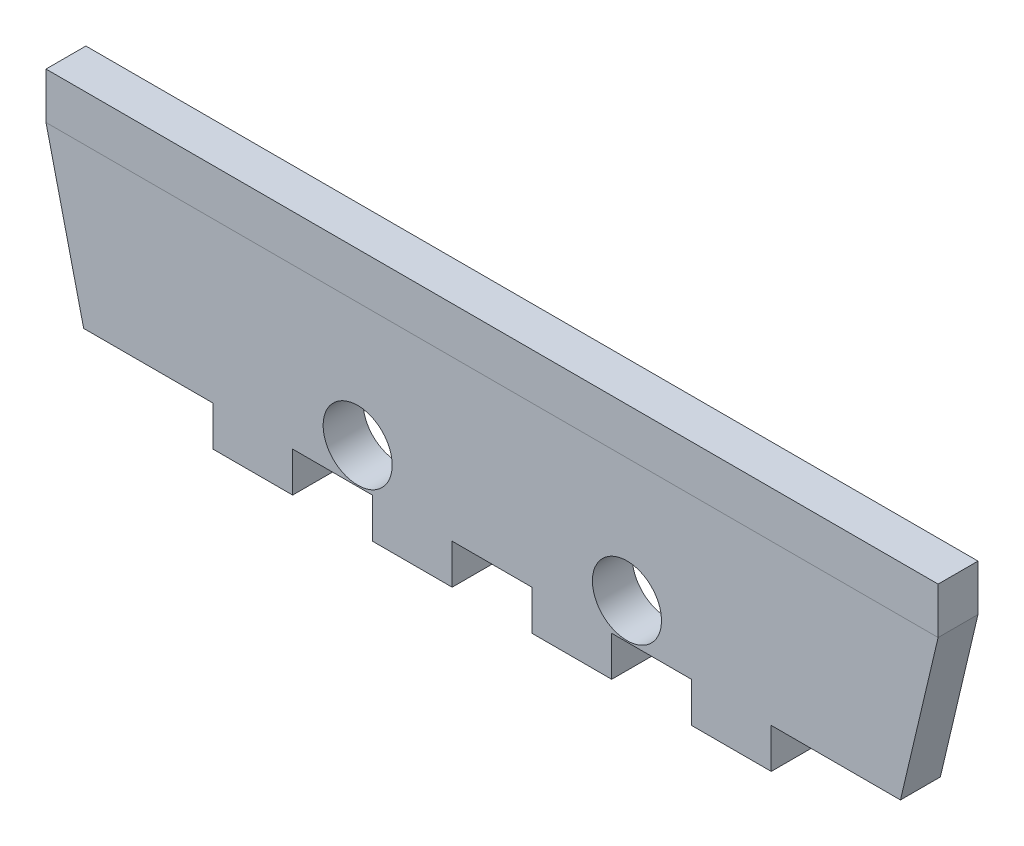
ISO-10303-21;
HEADER;
FILE_DESCRIPTION(('STEP AP214'),'2;1');
FILE_NAME('part.step','',(''),(''),'','','');
FILE_SCHEMA(('AUTOMOTIVE_DESIGN { 1 0 10303 214 1 1 1 1 }'));
ENDSEC;
DATA;
#1=APPLICATION_CONTEXT('core data for automotive mechanical design processes');
#2=APPLICATION_PROTOCOL_DEFINITION('international standard','automotive_design',2000,#1);
#3=PRODUCT_CONTEXT('',#1,'mechanical');
#4=PRODUCT('Part','Part','',(#3));
#5=PRODUCT_RELATED_PRODUCT_CATEGORY('part','',(#4));
#6=PRODUCT_DEFINITION_FORMATION('','',#4);
#7=PRODUCT_DEFINITION_CONTEXT('part definition',#1,'design');
#8=PRODUCT_DEFINITION('design','',#6,#7);
#9=PRODUCT_DEFINITION_SHAPE('','',#8);
#10=(LENGTH_UNIT() NAMED_UNIT(*) SI_UNIT(.MILLI.,.METRE.));
#11=(NAMED_UNIT(*) PLANE_ANGLE_UNIT() SI_UNIT($,.RADIAN.));
#12=(NAMED_UNIT(*) SI_UNIT($,.STERADIAN.) SOLID_ANGLE_UNIT());
#13=UNCERTAINTY_MEASURE_WITH_UNIT(LENGTH_MEASURE(1.E-05),#10,'distance_accuracy_value','');
#14=(GEOMETRIC_REPRESENTATION_CONTEXT(3) GLOBAL_UNCERTAINTY_ASSIGNED_CONTEXT((#13)) GLOBAL_UNIT_ASSIGNED_CONTEXT((#10,
#11,#12)) REPRESENTATION_CONTEXT('',''));
#15=CARTESIAN_POINT('',(0.,0.,0.));
#16=DIRECTION('',(0.,0.,1.));
#17=DIRECTION('',(1.,0.,0.));
#18=AXIS2_PLACEMENT_3D('',#15,#16,#17);
#19=CARTESIAN_POINT('',(-2.9972,0.,0.));
#20=DIRECTION('',(-1.,0.,0.));
#21=DIRECTION('',(0.,0.,1.));
#22=AXIS2_PLACEMENT_3D('',#19,#20,#21);
#23=PLANE('',#22);
#24=DIRECTION('',(0.,-1.,0.));
#25=VECTOR('',#24,1.);
#26=CARTESIAN_POINT('',(-2.9972,0.,3.175));
#27=LINE('',#26,#25);
#28=CARTESIAN_POINT('',(-2.9972,3.683,3.175));
#29=VERTEX_POINT('',#28);
#30=CARTESIAN_POINT('',(-2.9972,0.,3.175));
#31=VERTEX_POINT('',#30);
#32=EDGE_CURVE('E217',#29,#31,#27,.T.);
#33=ORIENTED_EDGE('',*,*,#32,.F.);
#34=DIRECTION('',(0.,0.,1.));
#35=VECTOR('',#34,1.);
#36=CARTESIAN_POINT('',(-2.9972,3.683,0.));
#37=LINE('',#36,#35);
#38=CARTESIAN_POINT('',(-2.9972,3.683,0.));
#39=VERTEX_POINT('',#38);
#40=EDGE_CURVE('E13',#39,#29,#37,.T.);
#41=ORIENTED_EDGE('',*,*,#40,.F.);
#42=DIRECTION('',(0.,-1.,0.));
#43=VECTOR('',#42,1.);
#44=CARTESIAN_POINT('',(-2.9972,0.,0.));
#45=LINE('',#44,#43);
#46=CARTESIAN_POINT('',(-2.9972,0.,0.));
#47=VERTEX_POINT('',#46);
#48=EDGE_CURVE('E211',#39,#47,#45,.T.);
#49=ORIENTED_EDGE('',*,*,#48,.T.);
#50=DIRECTION('',(0.,0.,1.));
#51=VECTOR('',#50,1.);
#52=CARTESIAN_POINT('',(-2.9972,0.,0.));
#53=LINE('',#52,#51);
#54=EDGE_CURVE('E156',#47,#31,#53,.T.);
#55=ORIENTED_EDGE('',*,*,#54,.T.);
#56=EDGE_LOOP('',(#33,#41,#49,#55));
#57=FACE_BOUND('',#56,.T.);
#58=ADVANCED_FACE('F153',(#57),#23,.T.);
#59=CARTESIAN_POINT('',(-2.9972,3.683,0.));
#60=DIRECTION('',(0.,1.,0.));
#61=DIRECTION('',(0.,0.,1.));
#62=AXIS2_PLACEMENT_3D('',#59,#60,#61);
#63=PLANE('',#62);
#64=DIRECTION('',(-1.,0.,0.));
#65=VECTOR('',#64,1.);
#66=CARTESIAN_POINT('',(-2.9972,3.683,3.175));
#67=LINE('',#66,#65);
#68=CARTESIAN_POINT('',(68.0212,3.683,3.175));
#69=VERTEX_POINT('',#68);
#70=EDGE_CURVE('E213',#69,#29,#67,.T.);
#71=ORIENTED_EDGE('',*,*,#70,.F.);
#72=DIRECTION('',(0.,0.,1.));
#73=VECTOR('',#72,1.);
#74=CARTESIAN_POINT('',(68.0212,3.683,0.));
#75=LINE('',#74,#73);
#76=CARTESIAN_POINT('',(68.0212,3.683,0.));
#77=VERTEX_POINT('',#76);
#78=EDGE_CURVE('E162',#77,#69,#75,.T.);
#79=ORIENTED_EDGE('',*,*,#78,.F.);
#80=DIRECTION('',(-1.,0.,0.));
#81=VECTOR('',#80,1.);
#82=CARTESIAN_POINT('',(-2.9972,3.683,0.));
#83=LINE('',#82,#81);
#84=EDGE_CURVE('E208',#77,#39,#83,.T.);
#85=ORIENTED_EDGE('',*,*,#84,.T.);
#86=ORIENTED_EDGE('',*,*,#40,.T.);
#87=EDGE_LOOP('',(#71,#79,#85,#86));
#88=FACE_BOUND('',#87,.T.);
#89=ADVANCED_FACE('F227',(#88),#63,.T.);
#90=CARTESIAN_POINT('',(68.0212,0.,0.));
#91=DIRECTION('',(1.,0.,0.));
#92=DIRECTION('',(0.,0.,-1.));
#93=AXIS2_PLACEMENT_3D('',#90,#91,#92);
#94=PLANE('',#93);
#95=DIRECTION('',(0.,1.,0.));
#96=VECTOR('',#95,1.);
#97=CARTESIAN_POINT('',(68.0212,0.,3.175));
#98=LINE('',#97,#96);
#99=CARTESIAN_POINT('',(68.0212,0.,3.175));
#100=VERTEX_POINT('',#99);
#101=EDGE_CURVE('E203',#100,#69,#98,.T.);
#102=ORIENTED_EDGE('',*,*,#101,.F.);
#103=DIRECTION('',(0.,0.,1.));
#104=VECTOR('',#103,1.);
#105=CARTESIAN_POINT('',(68.0212,0.,0.));
#106=LINE('',#105,#104);
#107=CARTESIAN_POINT('',(68.0212,0.,0.));
#108=VERTEX_POINT('',#107);
#109=EDGE_CURVE('E198',#108,#100,#106,.T.);
#110=ORIENTED_EDGE('',*,*,#109,.F.);
#111=DIRECTION('',(0.,1.,0.));
#112=VECTOR('',#111,1.);
#113=CARTESIAN_POINT('',(68.0212,0.,0.));
#114=LINE('',#113,#112);
#115=EDGE_CURVE('E201',#108,#77,#114,.T.);
#116=ORIENTED_EDGE('',*,*,#115,.T.);
#117=ORIENTED_EDGE('',*,*,#78,.T.);
#118=EDGE_LOOP('',(#102,#110,#116,#117));
#119=FACE_BOUND('',#118,.T.);
#120=ADVANCED_FACE('F200',(#119),#94,.T.);
#121=CARTESIAN_POINT('',(-2.9972,0.,0.));
#122=DIRECTION('',(0.,-1.,0.));
#123=DIRECTION('',(0.,0.,-1.));
#124=AXIS2_PLACEMENT_3D('',#121,#122,#123);
#125=PLANE('',#124);
#126=DIRECTION('',(1.,0.,0.));
#127=VECTOR('',#126,1.);
#128=CARTESIAN_POINT('',(-2.9972,0.,3.175));
#129=LINE('',#128,#127);
#130=EDGE_CURVE('E220',#31,#100,#129,.T.);
#131=ORIENTED_EDGE('',*,*,#130,.F.);
#132=ORIENTED_EDGE('',*,*,#54,.F.);
#133=DIRECTION('',(1.,0.,0.));
#134=VECTOR('',#133,1.);
#135=CARTESIAN_POINT('',(-2.9972,0.,0.));
#136=LINE('',#135,#134);
#137=EDGE_CURVE('E207',#47,#108,#136,.T.);
#138=ORIENTED_EDGE('',*,*,#137,.T.);
#139=ORIENTED_EDGE('',*,*,#109,.T.);
#140=EDGE_LOOP('',(#131,#132,#138,#139));
#141=FACE_BOUND('',#140,.T.);
#142=ADVANCED_FACE('F210',(#141),#125,.T.);
#143=CARTESIAN_POINT('',(0.,0.,0.));
#144=DIRECTION('',(0.,0.,-1.));
#145=DIRECTION('',(-1.,0.,0.));
#146=AXIS2_PLACEMENT_3D('',#143,#144,#145);
#147=PLANE('',#146);
#148=ORIENTED_EDGE('',*,*,#48,.F.);
#149=ORIENTED_EDGE('',*,*,#84,.F.);
#150=ORIENTED_EDGE('',*,*,#115,.F.);
#151=ORIENTED_EDGE('',*,*,#137,.F.);
#152=EDGE_LOOP('',(#148,#149,#150,#151));
#153=FACE_BOUND('',#152,.T.);
#154=ADVANCED_FACE('F206',(#153),#147,.T.);
#155=CARTESIAN_POINT('',(0.,0.,3.175));
#156=DIRECTION('',(0.,0.,-1.));
#157=DIRECTION('',(-1.,0.,0.));
#158=AXIS2_PLACEMENT_3D('',#155,#156,#157);
#159=PLANE('',#158);
#160=ORIENTED_EDGE('',*,*,#32,.T.);
#161=ORIENTED_EDGE('',*,*,#130,.T.);
#162=ORIENTED_EDGE('',*,*,#101,.T.);
#163=ORIENTED_EDGE('',*,*,#70,.T.);
#164=EDGE_LOOP('',(#160,#161,#162,#163));
#165=FACE_BOUND('',#164,.T.);
#166=ADVANCED_FACE('F226',(#165),#159,.F.);
#167=CLOSED_SHELL('',(#58,#89,#120,#142,#154,#166));
#168=MANIFOLD_SOLID_BREP('B2',#167);
#169=CARTESIAN_POINT('',(0.,-12.7,3.175));
#170=DIRECTION('',(0.,-1.,0.));
#171=DIRECTION('',(1.,0.,0.));
#172=AXIS2_PLACEMENT_3D('',#169,#170,#171);
#173=PLANE('',#172);
#174=DIRECTION('',(-1.,0.,0.));
#175=VECTOR('',#174,1.);
#176=CARTESIAN_POINT('',(0.,-12.7,0.));
#177=LINE('',#176,#175);
#178=CARTESIAN_POINT('',(65.024,-12.7,0.));
#179=VERTEX_POINT('',#178);
#180=CARTESIAN_POINT('',(54.737,-12.7,0.));
#181=VERTEX_POINT('',#180);
#182=EDGE_CURVE('E442',#179,#181,#177,.T.);
#183=ORIENTED_EDGE('',*,*,#182,.F.);
#184=DIRECTION('',(0.,0.,-1.));
#185=VECTOR('',#184,1.);
#186=CARTESIAN_POINT('',(65.024,-12.7,3.175));
#187=LINE('',#186,#185);
#188=CARTESIAN_POINT('',(65.024,-12.7,3.175));
#189=VERTEX_POINT('',#188);
#190=EDGE_CURVE('E151',#189,#179,#187,.T.);
#191=ORIENTED_EDGE('',*,*,#190,.F.);
#192=DIRECTION('',(-1.,0.,0.));
#193=VECTOR('',#192,1.);
#194=CARTESIAN_POINT('',(0.,-12.7,3.175));
#195=LINE('',#194,#193);
#196=CARTESIAN_POINT('',(54.737,-12.7,3.175));
#197=VERTEX_POINT('',#196);
#198=EDGE_CURVE('E489',#189,#197,#195,.T.);
#199=ORIENTED_EDGE('',*,*,#198,.T.);
#200=DIRECTION('',(0.,0.,-1.));
#201=VECTOR('',#200,1.);
#202=CARTESIAN_POINT('',(54.737,-12.7,3.175));
#203=LINE('',#202,#201);
#204=EDGE_CURVE('E293',#197,#181,#203,.T.);
#205=ORIENTED_EDGE('',*,*,#204,.T.);
#206=EDGE_LOOP('',(#183,#191,#199,#205));
#207=FACE_BOUND('',#206,.T.);
#208=ADVANCED_FACE('F276',(#207),#173,.T.);
#209=CARTESIAN_POINT('',(64.4325639199163,-15.2060850851003,3.175));
#210=DIRECTION('',(-0.973263781284483,0.229690252383138,0.));
#211=DIRECTION('',(-0.229690252383138,-0.973263781284483,0.));
#212=AXIS2_PLACEMENT_3D('',#209,#210,#211);
#213=PLANE('',#212);
#214=DIRECTION('',(0.229690252383138,0.973263781284483,0.));
#215=VECTOR('',#214,1.);
#216=CARTESIAN_POINT('',(64.4325639199163,-15.2060850851003,0.));
#217=LINE('',#216,#215);
#218=CARTESIAN_POINT('',(68.0212,0.,0.));
#219=VERTEX_POINT('',#218);
#220=EDGE_CURVE('E444',#179,#219,#217,.T.);
#221=ORIENTED_EDGE('',*,*,#220,.T.);
#222=DIRECTION('',(0.,0.,-1.));
#223=VECTOR('',#222,1.);
#224=CARTESIAN_POINT('',(68.0212,0.,3.175));
#225=LINE('',#224,#223);
#226=CARTESIAN_POINT('',(68.0212,0.,3.175));
#227=VERTEX_POINT('',#226);
#228=EDGE_CURVE('E285',#227,#219,#225,.T.);
#229=ORIENTED_EDGE('',*,*,#228,.F.);
#230=DIRECTION('',(0.229690252383138,0.973263781284483,0.));
#231=VECTOR('',#230,1.);
#232=CARTESIAN_POINT('',(64.4325639199163,-15.2060850851003,3.175));
#233=LINE('',#232,#231);
#234=EDGE_CURVE('E530',#189,#227,#233,.T.);
#235=ORIENTED_EDGE('',*,*,#234,.F.);
#236=ORIENTED_EDGE('',*,*,#190,.T.);
#237=EDGE_LOOP('',(#221,#229,#235,#236));
#238=FACE_BOUND('',#237,.T.);
#239=ADVANCED_FACE('F278',(#238),#213,.F.);
#240=CARTESIAN_POINT('',(0.,8.41812495417477E-13,3.175));
#241=DIRECTION('',(0.,-1.,0.));
#242=DIRECTION('',(1.,0.,0.));
#243=AXIS2_PLACEMENT_3D('',#240,#241,#242);
#244=PLANE('',#243);
#245=DIRECTION('',(0.,0.,-1.));
#246=VECTOR('',#245,1.);
#247=CARTESIAN_POINT('',(-2.9972,0.,3.175));
#248=LINE('',#247,#246);
#249=CARTESIAN_POINT('',(-2.9972,0.,3.175));
#250=VERTEX_POINT('',#249);
#251=CARTESIAN_POINT('',(-2.9972,0.,0.));
#252=VERTEX_POINT('',#251);
#253=EDGE_CURVE('E520',#250,#252,#248,.T.);
#254=ORIENTED_EDGE('',*,*,#253,.F.);
#255=DIRECTION('',(-1.,0.,0.));
#256=VECTOR('',#255,1.);
#257=CARTESIAN_POINT('',(0.,8.41812495417477E-13,3.175));
#258=LINE('',#257,#256);
#259=EDGE_CURVE('E528',#227,#250,#258,.T.);
#260=ORIENTED_EDGE('',*,*,#259,.F.);
#261=ORIENTED_EDGE('',*,*,#228,.T.);
#262=DIRECTION('',(-1.,0.,0.));
#263=VECTOR('',#262,1.);
#264=CARTESIAN_POINT('',(0.,8.41812495417477E-13,0.));
#265=LINE('',#264,#263);
#266=EDGE_CURVE('E450',#219,#252,#265,.T.);
#267=ORIENTED_EDGE('',*,*,#266,.T.);
#268=EDGE_LOOP('',(#254,#260,#261,#267));
#269=FACE_BOUND('',#268,.T.);
#270=ADVANCED_FACE('F527',(#269),#244,.F.);
#271=CARTESIAN_POINT('',(-2.83907488519422,-0.670021672905836,3.175));
#272=DIRECTION('',(-0.973263781284483,-0.229690252383138,0.));
#273=DIRECTION('',(0.229690252383138,-0.973263781284483,0.));
#274=AXIS2_PLACEMENT_3D('',#271,#272,#273);
#275=PLANE('',#274);
#276=DIRECTION('',(-0.229690252383138,0.973263781284483,0.));
#277=VECTOR('',#276,1.);
#278=CARTESIAN_POINT('',(-2.83907488519422,-0.670021672905836,0.));
#279=LINE('',#278,#277);
#280=CARTESIAN_POINT('',(0.,-12.7,0.));
#281=VERTEX_POINT('',#280);
#282=EDGE_CURVE('E452',#281,#252,#279,.T.);
#283=ORIENTED_EDGE('',*,*,#282,.F.);
#284=DIRECTION('',(0.,0.,-1.));
#285=VECTOR('',#284,1.);
#286=CARTESIAN_POINT('',(0.,-12.7,3.175));
#287=LINE('',#286,#285);
#288=CARTESIAN_POINT('',(0.,-12.7,3.175));
#289=VERTEX_POINT('',#288);
#290=EDGE_CURVE('E518',#289,#281,#287,.T.);
#291=ORIENTED_EDGE('',*,*,#290,.F.);
#292=DIRECTION('',(-0.229690252383138,0.973263781284483,0.));
#293=VECTOR('',#292,1.);
#294=CARTESIAN_POINT('',(-2.83907488519422,-0.670021672905836,3.175));
#295=LINE('',#294,#293);
#296=EDGE_CURVE('E634',#289,#250,#295,.T.);
#297=ORIENTED_EDGE('',*,*,#296,.T.);
#298=ORIENTED_EDGE('',*,*,#253,.T.);
#299=EDGE_LOOP('',(#283,#291,#297,#298));
#300=FACE_BOUND('',#299,.T.);
#301=ADVANCED_FACE('F546',(#300),#275,.T.);
#302=CARTESIAN_POINT('',(10.287,-12.7,0.));
#303=VERTEX_POINT('',#302);
#304=EDGE_CURVE('E447',#303,#281,#177,.T.);
#305=ORIENTED_EDGE('',*,*,#304,.F.);
#306=DIRECTION('',(0.,0.,-1.));
#307=VECTOR('',#306,1.);
#308=CARTESIAN_POINT('',(10.287,-12.7,3.175));
#309=LINE('',#308,#307);
#310=CARTESIAN_POINT('',(10.287,-12.7,3.175));
#311=VERTEX_POINT('',#310);
#312=EDGE_CURVE('E516',#311,#303,#309,.T.);
#313=ORIENTED_EDGE('',*,*,#312,.F.);
#314=EDGE_CURVE('E627',#311,#289,#195,.T.);
#315=ORIENTED_EDGE('',*,*,#314,.T.);
#316=ORIENTED_EDGE('',*,*,#290,.T.);
#317=EDGE_LOOP('',(#305,#313,#315,#316));
#318=FACE_BOUND('',#317,.T.);
#319=ADVANCED_FACE('F537',(#318),#173,.T.);
#320=CARTESIAN_POINT('',(10.287,0.,3.175));
#321=DIRECTION('',(1.,0.,0.));
#322=DIRECTION('',(0.,0.,-1.));
#323=AXIS2_PLACEMENT_3D('',#320,#321,#322);
#324=PLANE('',#323);
#325=DIRECTION('',(0.,-1.,0.));
#326=VECTOR('',#325,1.);
#327=CARTESIAN_POINT('',(10.287,0.,0.));
#328=LINE('',#327,#326);
#329=CARTESIAN_POINT('',(10.287,-15.875,0.));
#330=VERTEX_POINT('',#329);
#331=EDGE_CURVE('E455',#303,#330,#328,.T.);
#332=ORIENTED_EDGE('',*,*,#331,.T.);
#333=DIRECTION('',(0.,0.,-1.));
#334=VECTOR('',#333,1.);
#335=CARTESIAN_POINT('',(10.287,-15.875,3.175));
#336=LINE('',#335,#334);
#337=CARTESIAN_POINT('',(10.287,-15.875,3.175));
#338=VERTEX_POINT('',#337);
#339=EDGE_CURVE('E514',#338,#330,#336,.T.);
#340=ORIENTED_EDGE('',*,*,#339,.F.);
#341=DIRECTION('',(0.,-1.,0.));
#342=VECTOR('',#341,1.);
#343=CARTESIAN_POINT('',(10.287,0.,3.175));
#344=LINE('',#343,#342);
#345=EDGE_CURVE('E633',#311,#338,#344,.T.);
#346=ORIENTED_EDGE('',*,*,#345,.F.);
#347=ORIENTED_EDGE('',*,*,#312,.T.);
#348=EDGE_LOOP('',(#332,#340,#346,#347));
#349=FACE_BOUND('',#348,.T.);
#350=ADVANCED_FACE('F545',(#349),#324,.F.);
#351=CARTESIAN_POINT('',(0.,-15.875,3.175));
#352=DIRECTION('',(0.,-1.,0.));
#353=DIRECTION('',(1.,0.,0.));
#354=AXIS2_PLACEMENT_3D('',#351,#352,#353);
#355=PLANE('',#354);
#356=DIRECTION('',(-1.,0.,0.));
#357=VECTOR('',#356,1.);
#358=CARTESIAN_POINT('',(0.,-15.875,0.));
#359=LINE('',#358,#357);
#360=CARTESIAN_POINT('',(16.637,-15.875,0.));
#361=VERTEX_POINT('',#360);
#362=EDGE_CURVE('E458',#361,#330,#359,.T.);
#363=ORIENTED_EDGE('',*,*,#362,.F.);
#364=DIRECTION('',(0.,0.,-1.));
#365=VECTOR('',#364,1.);
#366=CARTESIAN_POINT('',(16.637,-15.875,3.175));
#367=LINE('',#366,#365);
#368=CARTESIAN_POINT('',(16.637,-15.875,3.175));
#369=VERTEX_POINT('',#368);
#370=EDGE_CURVE('E512',#369,#361,#367,.T.);
#371=ORIENTED_EDGE('',*,*,#370,.F.);
#372=DIRECTION('',(-1.,0.,0.));
#373=VECTOR('',#372,1.);
#374=CARTESIAN_POINT('',(0.,-15.875,3.175));
#375=LINE('',#374,#373);
#376=EDGE_CURVE('E628',#369,#338,#375,.T.);
#377=ORIENTED_EDGE('',*,*,#376,.T.);
#378=ORIENTED_EDGE('',*,*,#339,.T.);
#379=EDGE_LOOP('',(#363,#371,#377,#378));
#380=FACE_BOUND('',#379,.T.);
#381=ADVANCED_FACE('F584',(#380),#355,.T.);
#382=CARTESIAN_POINT('',(16.637,0.,3.175));
#383=DIRECTION('',(1.,0.,0.));
#384=DIRECTION('',(0.,0.,-1.));
#385=AXIS2_PLACEMENT_3D('',#382,#383,#384);
#386=PLANE('',#385);
#387=DIRECTION('',(0.,-1.,0.));
#388=VECTOR('',#387,1.);
#389=CARTESIAN_POINT('',(16.637,0.,0.));
#390=LINE('',#389,#388);
#391=CARTESIAN_POINT('',(16.637,-12.7,0.));
#392=VERTEX_POINT('',#391);
#393=EDGE_CURVE('E461',#392,#361,#390,.T.);
#394=ORIENTED_EDGE('',*,*,#393,.F.);
#395=DIRECTION('',(0.,0.,-1.));
#396=VECTOR('',#395,1.);
#397=CARTESIAN_POINT('',(16.637,-12.7,3.175));
#398=LINE('',#397,#396);
#399=CARTESIAN_POINT('',(16.637,-12.7,3.175));
#400=VERTEX_POINT('',#399);
#401=EDGE_CURVE('E510',#400,#392,#398,.T.);
#402=ORIENTED_EDGE('',*,*,#401,.F.);
#403=DIRECTION('',(0.,-1.,0.));
#404=VECTOR('',#403,1.);
#405=CARTESIAN_POINT('',(16.637,0.,3.175));
#406=LINE('',#405,#404);
#407=EDGE_CURVE('E625',#400,#369,#406,.T.);
#408=ORIENTED_EDGE('',*,*,#407,.T.);
#409=ORIENTED_EDGE('',*,*,#370,.T.);
#410=EDGE_LOOP('',(#394,#402,#408,#409));
#411=FACE_BOUND('',#410,.T.);
#412=ADVANCED_FACE('F576',(#411),#386,.T.);
#413=CARTESIAN_POINT('',(22.987,-12.7,0.));
#414=VERTEX_POINT('',#413);
#415=EDGE_CURVE('E464',#414,#392,#177,.T.);
#416=ORIENTED_EDGE('',*,*,#415,.F.);
#417=DIRECTION('',(0.,0.,-1.));
#418=VECTOR('',#417,1.);
#419=CARTESIAN_POINT('',(22.987,-12.7,3.175));
#420=LINE('',#419,#418);
#421=CARTESIAN_POINT('',(22.987,-12.7,3.175));
#422=VERTEX_POINT('',#421);
#423=EDGE_CURVE('E508',#422,#414,#420,.T.);
#424=ORIENTED_EDGE('',*,*,#423,.F.);
#425=EDGE_CURVE('E620',#422,#400,#195,.T.);
#426=ORIENTED_EDGE('',*,*,#425,.T.);
#427=ORIENTED_EDGE('',*,*,#401,.T.);
#428=EDGE_LOOP('',(#416,#424,#426,#427));
#429=FACE_BOUND('',#428,.T.);
#430=ADVANCED_FACE('F548',(#429),#173,.T.);
#431=CARTESIAN_POINT('',(22.987,0.,3.175));
#432=DIRECTION('',(1.,0.,0.));
#433=DIRECTION('',(0.,1.,0.));
#434=AXIS2_PLACEMENT_3D('',#431,#432,#433);
#435=PLANE('',#434);
#436=DIRECTION('',(0.,-1.,0.));
#437=VECTOR('',#436,1.);
#438=CARTESIAN_POINT('',(22.987,0.,0.));
#439=LINE('',#438,#437);
#440=CARTESIAN_POINT('',(22.987,-15.875,0.));
#441=VERTEX_POINT('',#440);
#442=EDGE_CURVE('E465',#414,#441,#439,.T.);
#443=ORIENTED_EDGE('',*,*,#442,.T.);
#444=DIRECTION('',(0.,0.,-1.));
#445=VECTOR('',#444,1.);
#446=CARTESIAN_POINT('',(22.987,-15.875,3.175));
#447=LINE('',#446,#445);
#448=CARTESIAN_POINT('',(22.987,-15.875,3.175));
#449=VERTEX_POINT('',#448);
#450=EDGE_CURVE('E506',#449,#441,#447,.T.);
#451=ORIENTED_EDGE('',*,*,#450,.F.);
#452=DIRECTION('',(0.,-1.,0.));
#453=VECTOR('',#452,1.);
#454=CARTESIAN_POINT('',(22.987,0.,3.175));
#455=LINE('',#454,#453);
#456=EDGE_CURVE('E618',#422,#449,#455,.T.);
#457=ORIENTED_EDGE('',*,*,#456,.F.);
#458=ORIENTED_EDGE('',*,*,#423,.T.);
#459=EDGE_LOOP('',(#443,#451,#457,#458));
#460=FACE_BOUND('',#459,.T.);
#461=ADVANCED_FACE('F575',(#460),#435,.F.);
#462=CARTESIAN_POINT('',(0.,-15.875,3.175));
#463=DIRECTION('',(0.,-1.,0.));
#464=DIRECTION('',(1.,0.,0.));
#465=AXIS2_PLACEMENT_3D('',#462,#463,#464);
#466=PLANE('',#465);
#467=DIRECTION('',(-1.,0.,0.));
#468=VECTOR('',#467,1.);
#469=CARTESIAN_POINT('',(0.,-15.875,0.));
#470=LINE('',#469,#468);
#471=CARTESIAN_POINT('',(29.337,-15.875,0.));
#472=VERTEX_POINT('',#471);
#473=EDGE_CURVE('E468',#472,#441,#470,.T.);
#474=ORIENTED_EDGE('',*,*,#473,.F.);
#475=DIRECTION('',(0.,0.,-1.));
#476=VECTOR('',#475,1.);
#477=CARTESIAN_POINT('',(29.337,-15.875,3.175));
#478=LINE('',#477,#476);
#479=CARTESIAN_POINT('',(29.337,-15.875,3.175));
#480=VERTEX_POINT('',#479);
#481=EDGE_CURVE('E504',#480,#472,#478,.T.);
#482=ORIENTED_EDGE('',*,*,#481,.F.);
#483=DIRECTION('',(-1.,0.,0.));
#484=VECTOR('',#483,1.);
#485=CARTESIAN_POINT('',(0.,-15.875,3.175));
#486=LINE('',#485,#484);
#487=EDGE_CURVE('E617',#480,#449,#486,.T.);
#488=ORIENTED_EDGE('',*,*,#487,.T.);
#489=ORIENTED_EDGE('',*,*,#450,.T.);
#490=EDGE_LOOP('',(#474,#482,#488,#489));
#491=FACE_BOUND('',#490,.T.);
#492=ADVANCED_FACE('F570',(#491),#466,.T.);
#493=CARTESIAN_POINT('',(29.337,0.,3.175));
#494=DIRECTION('',(1.,0.,0.));
#495=DIRECTION('',(0.,1.,0.));
#496=AXIS2_PLACEMENT_3D('',#493,#494,#495);
#497=PLANE('',#496);
#498=DIRECTION('',(0.,-1.,0.));
#499=VECTOR('',#498,1.);
#500=CARTESIAN_POINT('',(29.337,0.,0.));
#501=LINE('',#500,#499);
#502=CARTESIAN_POINT('',(29.337,-12.7,0.));
#503=VERTEX_POINT('',#502);
#504=EDGE_CURVE('E471',#503,#472,#501,.T.);
#505=ORIENTED_EDGE('',*,*,#504,.F.);
#506=DIRECTION('',(0.,0.,-1.));
#507=VECTOR('',#506,1.);
#508=CARTESIAN_POINT('',(29.337,-12.7,3.175));
#509=LINE('',#508,#507);
#510=CARTESIAN_POINT('',(29.337,-12.7,3.175));
#511=VERTEX_POINT('',#510);
#512=EDGE_CURVE('E502',#511,#503,#509,.T.);
#513=ORIENTED_EDGE('',*,*,#512,.F.);
#514=DIRECTION('',(0.,-1.,0.));
#515=VECTOR('',#514,1.);
#516=CARTESIAN_POINT('',(29.337,0.,3.175));
#517=LINE('',#516,#515);
#518=EDGE_CURVE('E636',#511,#480,#517,.T.);
#519=ORIENTED_EDGE('',*,*,#518,.T.);
#520=ORIENTED_EDGE('',*,*,#481,.T.);
#521=EDGE_LOOP('',(#505,#513,#519,#520));
#522=FACE_BOUND('',#521,.T.);
#523=ADVANCED_FACE('F562',(#522),#497,.T.);
#524=CARTESIAN_POINT('',(35.687,-12.7,0.));
#525=VERTEX_POINT('',#524);
#526=EDGE_CURVE('E474',#525,#503,#177,.T.);
#527=ORIENTED_EDGE('',*,*,#526,.F.);
#528=DIRECTION('',(0.,0.,-1.));
#529=VECTOR('',#528,1.);
#530=CARTESIAN_POINT('',(35.687,-12.7,3.175));
#531=LINE('',#530,#529);
#532=CARTESIAN_POINT('',(35.687,-12.7,3.175));
#533=VERTEX_POINT('',#532);
#534=EDGE_CURVE('E500',#533,#525,#531,.T.);
#535=ORIENTED_EDGE('',*,*,#534,.F.);
#536=EDGE_CURVE('E609',#533,#511,#195,.T.);
#537=ORIENTED_EDGE('',*,*,#536,.T.);
#538=ORIENTED_EDGE('',*,*,#512,.T.);
#539=EDGE_LOOP('',(#527,#535,#537,#538));
#540=FACE_BOUND('',#539,.T.);
#541=ADVANCED_FACE('F552',(#540),#173,.T.);
#542=CARTESIAN_POINT('',(35.687,0.,3.175));
#543=DIRECTION('',(1.,0.,0.));
#544=DIRECTION('',(0.,0.,-1.));
#545=AXIS2_PLACEMENT_3D('',#542,#543,#544);
#546=PLANE('',#545);
#547=DIRECTION('',(0.,-1.,0.));
#548=VECTOR('',#547,1.);
#549=CARTESIAN_POINT('',(35.687,0.,0.));
#550=LINE('',#549,#548);
#551=CARTESIAN_POINT('',(35.687,-15.875,0.));
#552=VERTEX_POINT('',#551);
#553=EDGE_CURVE('E475',#525,#552,#550,.T.);
#554=ORIENTED_EDGE('',*,*,#553,.T.);
#555=DIRECTION('',(0.,0.,-1.));
#556=VECTOR('',#555,1.);
#557=CARTESIAN_POINT('',(35.687,-15.875,3.175));
#558=LINE('',#557,#556);
#559=CARTESIAN_POINT('',(35.687,-15.875,3.175));
#560=VERTEX_POINT('',#559);
#561=EDGE_CURVE('E497',#560,#552,#558,.T.);
#562=ORIENTED_EDGE('',*,*,#561,.F.);
#563=DIRECTION('',(0.,-1.,0.));
#564=VECTOR('',#563,1.);
#565=CARTESIAN_POINT('',(35.687,0.,3.175));
#566=LINE('',#565,#564);
#567=EDGE_CURVE('E635',#533,#560,#566,.T.);
#568=ORIENTED_EDGE('',*,*,#567,.F.);
#569=ORIENTED_EDGE('',*,*,#534,.T.);
#570=EDGE_LOOP('',(#554,#562,#568,#569));
#571=FACE_BOUND('',#570,.T.);
#572=ADVANCED_FACE('F561',(#571),#546,.F.);
#573=CARTESIAN_POINT('',(0.,-15.875,3.175));
#574=DIRECTION('',(0.,1.,0.));
#575=DIRECTION('',(0.,0.,1.));
#576=AXIS2_PLACEMENT_3D('',#573,#574,#575);
#577=PLANE('',#576);
#578=DIRECTION('',(1.,0.,0.));
#579=VECTOR('',#578,1.);
#580=CARTESIAN_POINT('',(0.,-15.875,0.));
#581=LINE('',#580,#579);
#582=CARTESIAN_POINT('',(42.037,-15.875,0.));
#583=VERTEX_POINT('',#582);
#584=EDGE_CURVE('E477',#552,#583,#581,.T.);
#585=ORIENTED_EDGE('',*,*,#584,.T.);
#586=DIRECTION('',(0.,0.,-1.));
#587=VECTOR('',#586,1.);
#588=CARTESIAN_POINT('',(42.037,-15.875,3.175));
#589=LINE('',#588,#587);
#590=CARTESIAN_POINT('',(42.037,-15.875,3.175));
#591=VERTEX_POINT('',#590);
#592=EDGE_CURVE('E495',#591,#583,#589,.T.);
#593=ORIENTED_EDGE('',*,*,#592,.F.);
#594=DIRECTION('',(1.,0.,0.));
#595=VECTOR('',#594,1.);
#596=CARTESIAN_POINT('',(0.,-15.875,3.175));
#597=LINE('',#596,#595);
#598=EDGE_CURVE('E637',#560,#591,#597,.T.);
#599=ORIENTED_EDGE('',*,*,#598,.F.);
#600=ORIENTED_EDGE('',*,*,#561,.T.);
#601=EDGE_LOOP('',(#585,#593,#599,#600));
#602=FACE_BOUND('',#601,.T.);
#603=ADVANCED_FACE('F557',(#602),#577,.F.);
#604=CARTESIAN_POINT('',(42.037,0.,3.175));
#605=DIRECTION('',(1.,0.,0.));
#606=DIRECTION('',(0.,0.,-1.));
#607=AXIS2_PLACEMENT_3D('',#604,#605,#606);
#608=PLANE('',#607);
#609=DIRECTION('',(0.,-1.,0.));
#610=VECTOR('',#609,1.);
#611=CARTESIAN_POINT('',(42.037,0.,0.));
#612=LINE('',#611,#610);
#613=CARTESIAN_POINT('',(42.037,-12.7,0.));
#614=VERTEX_POINT('',#613);
#615=EDGE_CURVE('E480',#614,#583,#612,.T.);
#616=ORIENTED_EDGE('',*,*,#615,.F.);
#617=DIRECTION('',(0.,0.,-1.));
#618=VECTOR('',#617,1.);
#619=CARTESIAN_POINT('',(42.037,-12.7,3.175));
#620=LINE('',#619,#618);
#621=CARTESIAN_POINT('',(42.037,-12.7,3.175));
#622=VERTEX_POINT('',#621);
#623=EDGE_CURVE('E493',#622,#614,#620,.T.);
#624=ORIENTED_EDGE('',*,*,#623,.F.);
#625=DIRECTION('',(0.,-1.,0.));
#626=VECTOR('',#625,1.);
#627=CARTESIAN_POINT('',(42.037,0.,3.175));
#628=LINE('',#627,#626);
#629=EDGE_CURVE('E601',#622,#591,#628,.T.);
#630=ORIENTED_EDGE('',*,*,#629,.T.);
#631=ORIENTED_EDGE('',*,*,#592,.T.);
#632=EDGE_LOOP('',(#616,#624,#630,#631));
#633=FACE_BOUND('',#632,.T.);
#634=ADVANCED_FACE('F550',(#633),#608,.T.);
#635=CARTESIAN_POINT('',(48.387,-12.7,0.));
#636=VERTEX_POINT('',#635);
#637=EDGE_CURVE('E446',#636,#614,#177,.T.);
#638=ORIENTED_EDGE('',*,*,#637,.F.);
#639=DIRECTION('',(0.,0.,-1.));
#640=VECTOR('',#639,1.);
#641=CARTESIAN_POINT('',(48.387,-12.7,3.175));
#642=LINE('',#641,#640);
#643=CARTESIAN_POINT('',(48.387,-12.7,3.175));
#644=VERTEX_POINT('',#643);
#645=EDGE_CURVE('E434',#644,#636,#642,.T.);
#646=ORIENTED_EDGE('',*,*,#645,.F.);
#647=EDGE_CURVE('E424',#644,#622,#195,.T.);
#648=ORIENTED_EDGE('',*,*,#647,.T.);
#649=ORIENTED_EDGE('',*,*,#623,.T.);
#650=EDGE_LOOP('',(#638,#646,#648,#649));
#651=FACE_BOUND('',#650,.T.);
#652=ADVANCED_FACE('F538',(#651),#173,.T.);
#653=CARTESIAN_POINT('',(48.387,0.,3.175));
#654=DIRECTION('',(1.,0.,0.));
#655=DIRECTION('',(0.,0.,-1.));
#656=AXIS2_PLACEMENT_3D('',#653,#654,#655);
#657=PLANE('',#656);
#658=DIRECTION('',(0.,-1.,0.));
#659=VECTOR('',#658,1.);
#660=CARTESIAN_POINT('',(48.387,0.,0.));
#661=LINE('',#660,#659);
#662=CARTESIAN_POINT('',(48.387,-15.875,0.));
#663=VERTEX_POINT('',#662);
#664=EDGE_CURVE('E431',#636,#663,#661,.T.);
#665=ORIENTED_EDGE('',*,*,#664,.T.);
#666=DIRECTION('',(0.,0.,-1.));
#667=VECTOR('',#666,1.);
#668=CARTESIAN_POINT('',(48.387,-15.875,3.175));
#669=LINE('',#668,#667);
#670=CARTESIAN_POINT('',(48.387,-15.875,3.175));
#671=VERTEX_POINT('',#670);
#672=EDGE_CURVE('E428',#671,#663,#669,.T.);
#673=ORIENTED_EDGE('',*,*,#672,.F.);
#674=DIRECTION('',(0.,-1.,0.));
#675=VECTOR('',#674,1.);
#676=CARTESIAN_POINT('',(48.387,0.,3.175));
#677=LINE('',#676,#675);
#678=EDGE_CURVE('E416',#644,#671,#677,.T.);
#679=ORIENTED_EDGE('',*,*,#678,.F.);
#680=ORIENTED_EDGE('',*,*,#645,.T.);
#681=EDGE_LOOP('',(#665,#673,#679,#680));
#682=FACE_BOUND('',#681,.T.);
#683=ADVANCED_FACE('F429',(#682),#657,.F.);
#684=CARTESIAN_POINT('',(0.,-15.875,3.175));
#685=DIRECTION('',(0.,1.,0.));
#686=DIRECTION('',(-1.,0.,0.));
#687=AXIS2_PLACEMENT_3D('',#684,#685,#686);
#688=PLANE('',#687);
#689=DIRECTION('',(1.,0.,0.));
#690=VECTOR('',#689,1.);
#691=CARTESIAN_POINT('',(0.,-15.875,0.));
#692=LINE('',#691,#690);
#693=CARTESIAN_POINT('',(54.737,-15.875,0.));
#694=VERTEX_POINT('',#693);
#695=EDGE_CURVE('E484',#663,#694,#692,.T.);
#696=ORIENTED_EDGE('',*,*,#695,.T.);
#697=DIRECTION('',(0.,0.,-1.));
#698=VECTOR('',#697,1.);
#699=CARTESIAN_POINT('',(54.737,-15.875,3.175));
#700=LINE('',#699,#698);
#701=CARTESIAN_POINT('',(54.737,-15.875,3.175));
#702=VERTEX_POINT('',#701);
#703=EDGE_CURVE('E355',#702,#694,#700,.T.);
#704=ORIENTED_EDGE('',*,*,#703,.F.);
#705=DIRECTION('',(1.,0.,0.));
#706=VECTOR('',#705,1.);
#707=CARTESIAN_POINT('',(0.,-15.875,3.175));
#708=LINE('',#707,#706);
#709=EDGE_CURVE('E421',#671,#702,#708,.T.);
#710=ORIENTED_EDGE('',*,*,#709,.F.);
#711=ORIENTED_EDGE('',*,*,#672,.T.);
#712=EDGE_LOOP('',(#696,#704,#710,#711));
#713=FACE_BOUND('',#712,.T.);
#714=ADVANCED_FACE('F436',(#713),#688,.F.);
#715=CARTESIAN_POINT('',(54.737,0.,3.175));
#716=DIRECTION('',(1.,0.,0.));
#717=DIRECTION('',(0.,0.,-1.));
#718=AXIS2_PLACEMENT_3D('',#715,#716,#717);
#719=PLANE('',#718);
#720=DIRECTION('',(0.,-1.,0.));
#721=VECTOR('',#720,1.);
#722=CARTESIAN_POINT('',(54.737,0.,0.));
#723=LINE('',#722,#721);
#724=EDGE_CURVE('E486',#181,#694,#723,.T.);
#725=ORIENTED_EDGE('',*,*,#724,.F.);
#726=ORIENTED_EDGE('',*,*,#204,.F.);
#727=DIRECTION('',(0.,-1.,0.));
#728=VECTOR('',#727,1.);
#729=CARTESIAN_POINT('',(54.737,0.,3.175));
#730=LINE('',#729,#728);
#731=EDGE_CURVE('E437',#197,#702,#730,.T.);
#732=ORIENTED_EDGE('',*,*,#731,.T.);
#733=ORIENTED_EDGE('',*,*,#703,.T.);
#734=EDGE_LOOP('',(#725,#726,#732,#733));
#735=FACE_BOUND('',#734,.T.);
#736=ADVANCED_FACE('F701',(#735),#719,.T.);
#737=CARTESIAN_POINT('',(0.,0.,3.175));
#738=DIRECTION('',(0.,0.,1.));
#739=DIRECTION('',(1.,0.,0.));
#740=AXIS2_PLACEMENT_3D('',#737,#738,#739);
#741=PLANE('',#740);
#742=CARTESIAN_POINT('',(43.2505698195968,-9.84879999999999,3.175));
#743=DIRECTION('',(0.,0.,-1.));
#744=DIRECTION('',(-1.,0.,0.));
#745=AXIS2_PLACEMENT_3D('',#742,#743,#744);
#746=CIRCLE('',#745,2.75);
#747=CARTESIAN_POINT('',(40.5005698195968,-9.84879999999999,3.175));
#748=VERTEX_POINT('',#747);
#749=EDGE_CURVE('E758',#748,#748,#746,.T.);
#750=ORIENTED_EDGE('',*,*,#749,.T.);
#751=EDGE_LOOP('',(#750));
#752=FACE_BOUND('',#751,.T.);
#753=CARTESIAN_POINT('',(21.8129698195968,-9.84879999999999,3.175));
#754=DIRECTION('',(0.,0.,-1.));
#755=DIRECTION('',(-1.,0.,0.));
#756=AXIS2_PLACEMENT_3D('',#753,#754,#755);
#757=CIRCLE('',#756,2.75);
#758=CARTESIAN_POINT('',(19.0629698195968,-9.84879999999999,3.175));
#759=VERTEX_POINT('',#758);
#760=EDGE_CURVE('E445',#759,#759,#757,.T.);
#761=ORIENTED_EDGE('',*,*,#760,.T.);
#762=EDGE_LOOP('',(#761));
#763=FACE_BOUND('',#762,.T.);
#764=ORIENTED_EDGE('',*,*,#259,.T.);
#765=ORIENTED_EDGE('',*,*,#296,.F.);
#766=ORIENTED_EDGE('',*,*,#314,.F.);
#767=ORIENTED_EDGE('',*,*,#345,.T.);
#768=ORIENTED_EDGE('',*,*,#376,.F.);
#769=ORIENTED_EDGE('',*,*,#407,.F.);
#770=ORIENTED_EDGE('',*,*,#425,.F.);
#771=ORIENTED_EDGE('',*,*,#456,.T.);
#772=ORIENTED_EDGE('',*,*,#487,.F.);
#773=ORIENTED_EDGE('',*,*,#518,.F.);
#774=ORIENTED_EDGE('',*,*,#536,.F.);
#775=ORIENTED_EDGE('',*,*,#567,.T.);
#776=ORIENTED_EDGE('',*,*,#598,.T.);
#777=ORIENTED_EDGE('',*,*,#629,.F.);
#778=ORIENTED_EDGE('',*,*,#647,.F.);
#779=ORIENTED_EDGE('',*,*,#678,.T.);
#780=ORIENTED_EDGE('',*,*,#709,.T.);
#781=ORIENTED_EDGE('',*,*,#731,.F.);
#782=ORIENTED_EDGE('',*,*,#198,.F.);
#783=ORIENTED_EDGE('',*,*,#234,.T.);
#784=EDGE_LOOP('',(#764,#765,#766,#767,#768,#769,#770,#771,#772,#773,#774,#775,#776,#777,#778,
#779,#780,#781,#782,#783));
#785=FACE_BOUND('',#784,.T.);
#786=ADVANCED_FACE('F418',(#752,#763,#785),#741,.T.);
#787=CARTESIAN_POINT('',(0.,0.,0.));
#788=DIRECTION('',(0.,0.,1.));
#789=DIRECTION('',(1.,0.,0.));
#790=AXIS2_PLACEMENT_3D('',#787,#788,#789);
#791=PLANE('',#790);
#792=CARTESIAN_POINT('',(43.2505698195968,-9.84879999999999,0.));
#793=DIRECTION('',(0.,0.,-1.));
#794=DIRECTION('',(-1.,0.,0.));
#795=AXIS2_PLACEMENT_3D('',#792,#793,#794);
#796=CIRCLE('',#795,2.75);
#797=CARTESIAN_POINT('',(40.5005698195968,-9.84879999999999,0.));
#798=VERTEX_POINT('',#797);
#799=EDGE_CURVE('E761',#798,#798,#796,.T.);
#800=ORIENTED_EDGE('',*,*,#799,.F.);
#801=EDGE_LOOP('',(#800));
#802=FACE_BOUND('',#801,.T.);
#803=CARTESIAN_POINT('',(21.8129698195968,-9.84879999999999,0.));
#804=DIRECTION('',(0.,0.,-1.));
#805=DIRECTION('',(-1.,0.,0.));
#806=AXIS2_PLACEMENT_3D('',#803,#804,#805);
#807=CIRCLE('',#806,2.75);
#808=CARTESIAN_POINT('',(19.0629698195968,-9.84879999999999,0.));
#809=VERTEX_POINT('',#808);
#810=EDGE_CURVE('E763',#809,#809,#807,.T.);
#811=ORIENTED_EDGE('',*,*,#810,.F.);
#812=EDGE_LOOP('',(#811));
#813=FACE_BOUND('',#812,.T.);
#814=ORIENTED_EDGE('',*,*,#266,.F.);
#815=ORIENTED_EDGE('',*,*,#220,.F.);
#816=ORIENTED_EDGE('',*,*,#182,.T.);
#817=ORIENTED_EDGE('',*,*,#724,.T.);
#818=ORIENTED_EDGE('',*,*,#695,.F.);
#819=ORIENTED_EDGE('',*,*,#664,.F.);
#820=ORIENTED_EDGE('',*,*,#637,.T.);
#821=ORIENTED_EDGE('',*,*,#615,.T.);
#822=ORIENTED_EDGE('',*,*,#584,.F.);
#823=ORIENTED_EDGE('',*,*,#553,.F.);
#824=ORIENTED_EDGE('',*,*,#526,.T.);
#825=ORIENTED_EDGE('',*,*,#504,.T.);
#826=ORIENTED_EDGE('',*,*,#473,.T.);
#827=ORIENTED_EDGE('',*,*,#442,.F.);
#828=ORIENTED_EDGE('',*,*,#415,.T.);
#829=ORIENTED_EDGE('',*,*,#393,.T.);
#830=ORIENTED_EDGE('',*,*,#362,.T.);
#831=ORIENTED_EDGE('',*,*,#331,.F.);
#832=ORIENTED_EDGE('',*,*,#304,.T.);
#833=ORIENTED_EDGE('',*,*,#282,.T.);
#834=EDGE_LOOP('',(#814,#815,#816,#817,#818,#819,#820,#821,#822,#823,#824,#825,#826,#827,#828,
#829,#830,#831,#832,#833));
#835=FACE_BOUND('',#834,.T.);
#836=ADVANCED_FACE('F534',(#802,#813,#835),#791,.F.);
#837=CARTESIAN_POINT('',(21.8129698195968,-9.84879999999999,3.175));
#838=DIRECTION('',(0.,0.,-1.));
#839=DIRECTION('',(-1.,0.,0.));
#840=AXIS2_PLACEMENT_3D('',#837,#838,#839);
#841=CYLINDRICAL_SURFACE('',#840,2.75);
#842=ORIENTED_EDGE('',*,*,#760,.F.);
#843=EDGE_LOOP('',(#842));
#844=FACE_BOUND('',#843,.T.);
#845=ORIENTED_EDGE('',*,*,#810,.T.);
#846=EDGE_LOOP('',(#845));
#847=FACE_BOUND('',#846,.T.);
#848=ADVANCED_FACE('F733',(#844,#847),#841,.F.);
#849=CARTESIAN_POINT('',(43.2505698195968,-9.84879999999999,3.175));
#850=DIRECTION('',(0.,0.,-1.));
#851=DIRECTION('',(-1.,0.,0.));
#852=AXIS2_PLACEMENT_3D('',#849,#850,#851);
#853=CYLINDRICAL_SURFACE('',#852,2.75);
#854=ORIENTED_EDGE('',*,*,#749,.F.);
#855=EDGE_LOOP('',(#854));
#856=FACE_BOUND('',#855,.T.);
#857=ORIENTED_EDGE('',*,*,#799,.T.);
#858=EDGE_LOOP('',(#857));
#859=FACE_BOUND('',#858,.T.);
#860=ADVANCED_FACE('F741',(#856,#859),#853,.F.);
#861=CLOSED_SHELL('',(#208,#239,#270,#301,#319,#350,#381,#412,#430,#461,#492,#523,#541,#572,
#603,#634,#652,#683,#714,#736,#786,#836,#848,#860));
#862=MANIFOLD_SOLID_BREP('B7',#861);
#863=ADVANCED_BREP_SHAPE_REPRESENTATION('',(#18,#168,#862),#14);
#864=SHAPE_DEFINITION_REPRESENTATION(#9,#863);
ENDSEC;
END-ISO-10303-21;
